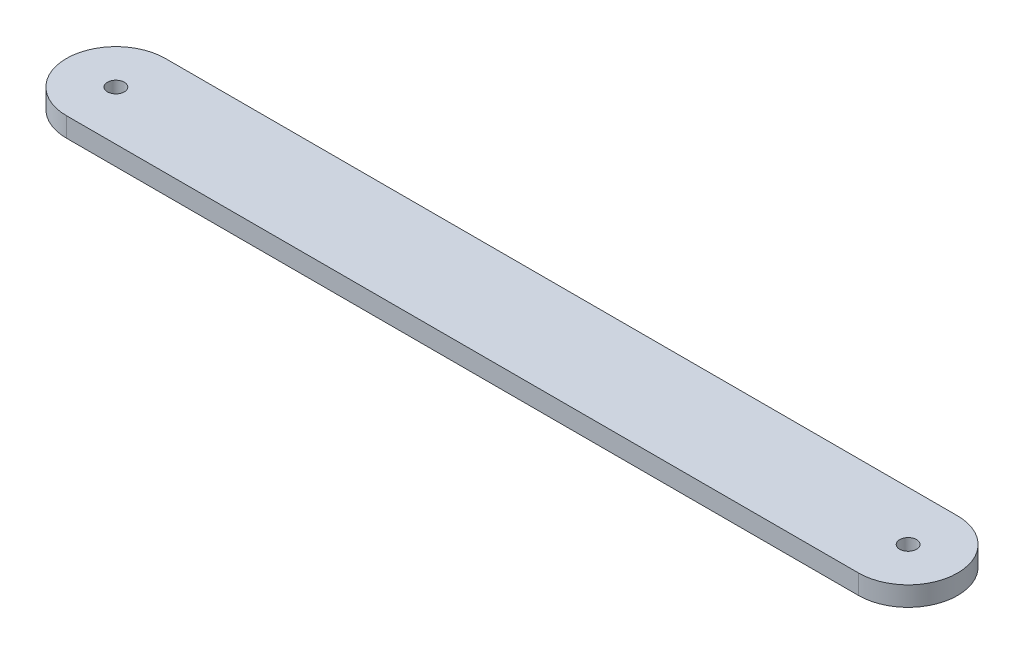
ISO-10303-21;
HEADER;
FILE_DESCRIPTION(('STEP AP214'),'2;1');
FILE_NAME('part.step','',(''),(''),'','','');
FILE_SCHEMA(('AUTOMOTIVE_DESIGN { 1 0 10303 214 1 1 1 1 }'));
ENDSEC;
DATA;
#1=APPLICATION_CONTEXT('core data for automotive mechanical design processes');
#2=APPLICATION_PROTOCOL_DEFINITION('international standard','automotive_design',2000,#1);
#3=PRODUCT_CONTEXT('',#1,'mechanical');
#4=PRODUCT('Part','Part','',(#3));
#5=PRODUCT_RELATED_PRODUCT_CATEGORY('part','',(#4));
#6=PRODUCT_DEFINITION_FORMATION('','',#4);
#7=PRODUCT_DEFINITION_CONTEXT('part definition',#1,'design');
#8=PRODUCT_DEFINITION('design','',#6,#7);
#9=PRODUCT_DEFINITION_SHAPE('','',#8);
#10=(LENGTH_UNIT() NAMED_UNIT(*) SI_UNIT(.MILLI.,.METRE.));
#11=(NAMED_UNIT(*) PLANE_ANGLE_UNIT() SI_UNIT($,.RADIAN.));
#12=(NAMED_UNIT(*) SI_UNIT($,.STERADIAN.) SOLID_ANGLE_UNIT());
#13=UNCERTAINTY_MEASURE_WITH_UNIT(LENGTH_MEASURE(1.E-05),#10,'distance_accuracy_value','');
#14=(GEOMETRIC_REPRESENTATION_CONTEXT(3) GLOBAL_UNCERTAINTY_ASSIGNED_CONTEXT((#13)) GLOBAL_UNIT_ASSIGNED_CONTEXT((#10,
#11,#12)) REPRESENTATION_CONTEXT('',''));
#15=CARTESIAN_POINT('',(0.,0.,0.));
#16=DIRECTION('',(0.,0.,1.));
#17=DIRECTION('',(1.,0.,0.));
#18=AXIS2_PLACEMENT_3D('',#15,#16,#17);
#19=CARTESIAN_POINT('',(128.519446753901,5.0038,20.3731858618791));
#20=DIRECTION('',(0.,-1.,0.));
#21=DIRECTION('',(0.,0.,-1.));
#22=AXIS2_PLACEMENT_3D('',#19,#20,#21);
#23=CYLINDRICAL_SURFACE('',#22,12.7);
#24=CARTESIAN_POINT('',(128.519446753901,0.,20.3731858618791));
#25=DIRECTION('',(0.,1.,0.));
#26=DIRECTION('',(0.,0.,1.));
#27=AXIS2_PLACEMENT_3D('',#24,#25,#26);
#28=CIRCLE('',#27,12.7);
#29=CARTESIAN_POINT('',(128.519446753901,0.,7.67318586187911));
#30=VERTEX_POINT('',#29);
#31=CARTESIAN_POINT('',(128.519446753901,0.,33.0731858618791));
#32=VERTEX_POINT('',#31);
#33=EDGE_CURVE('E135',#30,#32,#28,.F.);
#34=ORIENTED_EDGE('',*,*,#33,.F.);
#35=DIRECTION('',(0.,-1.,0.));
#36=VECTOR('',#35,1.);
#37=CARTESIAN_POINT('',(128.519446753901,5.0038,7.67318586187911));
#38=LINE('',#37,#36);
#39=CARTESIAN_POINT('',(128.519446753901,5.0038,7.67318586187911));
#40=VERTEX_POINT('',#39);
#41=EDGE_CURVE('E12',#40,#30,#38,.T.);
#42=ORIENTED_EDGE('',*,*,#41,.F.);
#43=CARTESIAN_POINT('',(128.519446753901,5.0038,20.3731858618791));
#44=DIRECTION('',(0.,1.,0.));
#45=DIRECTION('',(0.,0.,1.));
#46=AXIS2_PLACEMENT_3D('',#43,#44,#45);
#47=CIRCLE('',#46,12.7);
#48=CARTESIAN_POINT('',(128.519446753901,5.0038,33.0731858618791));
#49=VERTEX_POINT('',#48);
#50=EDGE_CURVE('E101',#40,#49,#47,.F.);
#51=ORIENTED_EDGE('',*,*,#50,.T.);
#52=DIRECTION('',(0.,-1.,0.));
#53=VECTOR('',#52,1.);
#54=CARTESIAN_POINT('',(128.519446753901,5.0038,33.0731858618791));
#55=LINE('',#54,#53);
#56=EDGE_CURVE('E82',#49,#32,#55,.T.);
#57=ORIENTED_EDGE('',*,*,#56,.T.);
#58=EDGE_LOOP('',(#34,#42,#51,#57));
#59=FACE_BOUND('',#58,.T.);
#60=ADVANCED_FACE('F42',(#59),#23,.T.);
#61=CARTESIAN_POINT('',(0.,5.0038,7.67318586187911));
#62=DIRECTION('',(0.,0.,-1.));
#63=DIRECTION('',(-1.,0.,0.));
#64=AXIS2_PLACEMENT_3D('',#61,#62,#63);
#65=PLANE('',#64);
#66=DIRECTION('',(1.,0.,0.));
#67=VECTOR('',#66,1.);
#68=CARTESIAN_POINT('',(0.,0.,7.67318586187911));
#69=LINE('',#68,#67);
#70=CARTESIAN_POINT('',(-74.6805532460989,0.,7.67318586187911));
#71=VERTEX_POINT('',#70);
#72=EDGE_CURVE('E93',#71,#30,#69,.T.);
#73=ORIENTED_EDGE('',*,*,#72,.F.);
#74=DIRECTION('',(0.,-1.,0.));
#75=VECTOR('',#74,1.);
#76=CARTESIAN_POINT('',(-74.6805532460989,5.0038,7.67318586187911));
#77=LINE('',#76,#75);
#78=CARTESIAN_POINT('',(-74.6805532460989,5.0038,7.67318586187911));
#79=VERTEX_POINT('',#78);
#80=EDGE_CURVE('E52',#79,#71,#77,.T.);
#81=ORIENTED_EDGE('',*,*,#80,.F.);
#82=DIRECTION('',(1.,0.,0.));
#83=VECTOR('',#82,1.);
#84=CARTESIAN_POINT('',(0.,5.0038,7.67318586187911));
#85=LINE('',#84,#83);
#86=EDGE_CURVE('E91',#79,#40,#85,.T.);
#87=ORIENTED_EDGE('',*,*,#86,.T.);
#88=ORIENTED_EDGE('',*,*,#41,.T.);
#89=EDGE_LOOP('',(#73,#81,#87,#88));
#90=FACE_BOUND('',#89,.T.);
#91=ADVANCED_FACE('F90',(#90),#65,.T.);
#92=CARTESIAN_POINT('',(-74.6805532460989,5.0038,20.3731858618791));
#93=DIRECTION('',(0.,-1.,0.));
#94=DIRECTION('',(0.,0.,-1.));
#95=AXIS2_PLACEMENT_3D('',#92,#93,#94);
#96=CYLINDRICAL_SURFACE('',#95,12.7);
#97=CARTESIAN_POINT('',(-74.6805532460989,0.,20.3731858618791));
#98=DIRECTION('',(0.,1.,0.));
#99=DIRECTION('',(0.,0.,1.));
#100=AXIS2_PLACEMENT_3D('',#97,#98,#99);
#101=CIRCLE('',#100,12.7);
#102=CARTESIAN_POINT('',(-74.6805532460989,0.,33.0731858618791));
#103=VERTEX_POINT('',#102);
#104=EDGE_CURVE('E128',#103,#71,#101,.F.);
#105=ORIENTED_EDGE('',*,*,#104,.F.);
#106=DIRECTION('',(0.,-1.,0.));
#107=VECTOR('',#106,1.);
#108=CARTESIAN_POINT('',(-74.6805532460989,5.0038,33.0731858618791));
#109=LINE('',#108,#107);
#110=CARTESIAN_POINT('',(-74.6805532460989,5.0038,33.0731858618791));
#111=VERTEX_POINT('',#110);
#112=EDGE_CURVE('E75',#111,#103,#109,.T.);
#113=ORIENTED_EDGE('',*,*,#112,.F.);
#114=CARTESIAN_POINT('',(-74.6805532460989,5.0038,20.3731858618791));
#115=DIRECTION('',(0.,1.,0.));
#116=DIRECTION('',(0.,0.,1.));
#117=AXIS2_PLACEMENT_3D('',#114,#115,#116);
#118=CIRCLE('',#117,12.7);
#119=EDGE_CURVE('E100',#111,#79,#118,.F.);
#120=ORIENTED_EDGE('',*,*,#119,.T.);
#121=ORIENTED_EDGE('',*,*,#80,.T.);
#122=EDGE_LOOP('',(#105,#113,#120,#121));
#123=FACE_BOUND('',#122,.T.);
#124=ADVANCED_FACE('F104',(#123),#96,.T.);
#125=CARTESIAN_POINT('',(-74.6805532460989,5.0038,20.3731858618791));
#126=DIRECTION('',(0.,-1.,0.));
#127=DIRECTION('',(0.,0.,-1.));
#128=AXIS2_PLACEMENT_3D('',#125,#126,#127);
#129=CYLINDRICAL_SURFACE('',#128,2.15899999999999);
#130=CARTESIAN_POINT('',(-74.6805532460989,5.0038,20.3731858618791));
#131=DIRECTION('',(0.,1.,0.));
#132=DIRECTION('',(0.,0.,1.));
#133=AXIS2_PLACEMENT_3D('',#130,#131,#132);
#134=CIRCLE('',#133,2.15899999999999);
#135=CARTESIAN_POINT('',(-74.6805532460989,5.0038,22.5321858618791));
#136=VERTEX_POINT('',#135);
#137=EDGE_CURVE('E176',#136,#136,#134,.T.);
#138=ORIENTED_EDGE('',*,*,#137,.T.);
#139=EDGE_LOOP('',(#138));
#140=FACE_BOUND('',#139,.T.);
#141=CARTESIAN_POINT('',(-74.6805532460989,0.,20.3731858618791));
#142=DIRECTION('',(0.,1.,0.));
#143=DIRECTION('',(0.,0.,1.));
#144=AXIS2_PLACEMENT_3D('',#141,#142,#143);
#145=CIRCLE('',#144,2.15899999999999);
#146=CARTESIAN_POINT('',(-74.6805532460989,0.,22.5321858618791));
#147=VERTEX_POINT('',#146);
#148=EDGE_CURVE('E116',#147,#147,#145,.T.);
#149=ORIENTED_EDGE('',*,*,#148,.F.);
#150=EDGE_LOOP('',(#149));
#151=FACE_BOUND('',#150,.T.);
#152=ADVANCED_FACE('F145',(#140,#151),#129,.F.);
#153=CARTESIAN_POINT('',(128.519446753901,5.0038,20.3731858618791));
#154=DIRECTION('',(0.,-1.,0.));
#155=DIRECTION('',(0.,0.,-1.));
#156=AXIS2_PLACEMENT_3D('',#153,#154,#155);
#157=CYLINDRICAL_SURFACE('',#156,2.15899999999999);
#158=CARTESIAN_POINT('',(128.519446753901,5.0038,20.3731858618791));
#159=DIRECTION('',(0.,1.,0.));
#160=DIRECTION('',(0.,0.,1.));
#161=AXIS2_PLACEMENT_3D('',#158,#159,#160);
#162=CIRCLE('',#161,2.15899999999999);
#163=CARTESIAN_POINT('',(128.519446753901,5.0038,22.5321858618791));
#164=VERTEX_POINT('',#163);
#165=EDGE_CURVE('E127',#164,#164,#162,.T.);
#166=ORIENTED_EDGE('',*,*,#165,.T.);
#167=EDGE_LOOP('',(#166));
#168=FACE_BOUND('',#167,.T.);
#169=CARTESIAN_POINT('',(128.519446753901,0.,20.3731858618791));
#170=DIRECTION('',(0.,1.,0.));
#171=DIRECTION('',(0.,0.,1.));
#172=AXIS2_PLACEMENT_3D('',#169,#170,#171);
#173=CIRCLE('',#172,2.15899999999999);
#174=CARTESIAN_POINT('',(128.519446753901,0.,22.5321858618791));
#175=VERTEX_POINT('',#174);
#176=EDGE_CURVE('E111',#175,#175,#173,.T.);
#177=ORIENTED_EDGE('',*,*,#176,.F.);
#178=EDGE_LOOP('',(#177));
#179=FACE_BOUND('',#178,.T.);
#180=ADVANCED_FACE('F44',(#168,#179),#157,.F.);
#181=CARTESIAN_POINT('',(0.,5.0038,33.0731858618791));
#182=DIRECTION('',(0.,0.,-1.));
#183=DIRECTION('',(-1.,0.,0.));
#184=AXIS2_PLACEMENT_3D('',#181,#182,#183);
#185=PLANE('',#184);
#186=DIRECTION('',(1.,0.,0.));
#187=VECTOR('',#186,1.);
#188=CARTESIAN_POINT('',(0.,0.,33.0731858618791));
#189=LINE('',#188,#187);
#190=EDGE_CURVE('E122',#103,#32,#189,.T.);
#191=ORIENTED_EDGE('',*,*,#190,.T.);
#192=ORIENTED_EDGE('',*,*,#56,.F.);
#193=DIRECTION('',(1.,0.,0.));
#194=VECTOR('',#193,1.);
#195=CARTESIAN_POINT('',(0.,5.0038,33.0731858618791));
#196=LINE('',#195,#194);
#197=EDGE_CURVE('E60',#111,#49,#196,.T.);
#198=ORIENTED_EDGE('',*,*,#197,.F.);
#199=ORIENTED_EDGE('',*,*,#112,.T.);
#200=EDGE_LOOP('',(#191,#192,#198,#199));
#201=FACE_BOUND('',#200,.T.);
#202=ADVANCED_FACE('F152',(#201),#185,.F.);
#203=CARTESIAN_POINT('',(0.,5.0038,0.));
#204=DIRECTION('',(0.,1.,0.));
#205=DIRECTION('',(0.,0.,1.));
#206=AXIS2_PLACEMENT_3D('',#203,#204,#205);
#207=PLANE('',#206);
#208=ORIENTED_EDGE('',*,*,#165,.F.);
#209=EDGE_LOOP('',(#208));
#210=FACE_BOUND('',#209,.T.);
#211=ORIENTED_EDGE('',*,*,#137,.F.);
#212=EDGE_LOOP('',(#211));
#213=FACE_BOUND('',#212,.T.);
#214=ORIENTED_EDGE('',*,*,#50,.F.);
#215=ORIENTED_EDGE('',*,*,#86,.F.);
#216=ORIENTED_EDGE('',*,*,#119,.F.);
#217=ORIENTED_EDGE('',*,*,#197,.T.);
#218=EDGE_LOOP('',(#214,#215,#216,#217));
#219=FACE_BOUND('',#218,.T.);
#220=ADVANCED_FACE('F99',(#210,#213,#219),#207,.T.);
#221=CARTESIAN_POINT('',(0.,0.,0.));
#222=DIRECTION('',(0.,1.,0.));
#223=DIRECTION('',(0.,0.,1.));
#224=AXIS2_PLACEMENT_3D('',#221,#222,#223);
#225=PLANE('',#224);
#226=ORIENTED_EDGE('',*,*,#176,.T.);
#227=EDGE_LOOP('',(#226));
#228=FACE_BOUND('',#227,.T.);
#229=ORIENTED_EDGE('',*,*,#148,.T.);
#230=EDGE_LOOP('',(#229));
#231=FACE_BOUND('',#230,.T.);
#232=ORIENTED_EDGE('',*,*,#33,.T.);
#233=ORIENTED_EDGE('',*,*,#190,.F.);
#234=ORIENTED_EDGE('',*,*,#104,.T.);
#235=ORIENTED_EDGE('',*,*,#72,.T.);
#236=EDGE_LOOP('',(#232,#233,#234,#235));
#237=FACE_BOUND('',#236,.T.);
#238=ADVANCED_FACE('F143',(#228,#231,#237),#225,.F.);
#239=CLOSED_SHELL('',(#60,#91,#124,#152,#180,#202,#220,#238));
#240=MANIFOLD_SOLID_BREP('B2',#239);
#241=ADVANCED_BREP_SHAPE_REPRESENTATION('',(#18,#240),#14);
#242=SHAPE_DEFINITION_REPRESENTATION(#9,#241);
ENDSEC;
END-ISO-10303-21;
